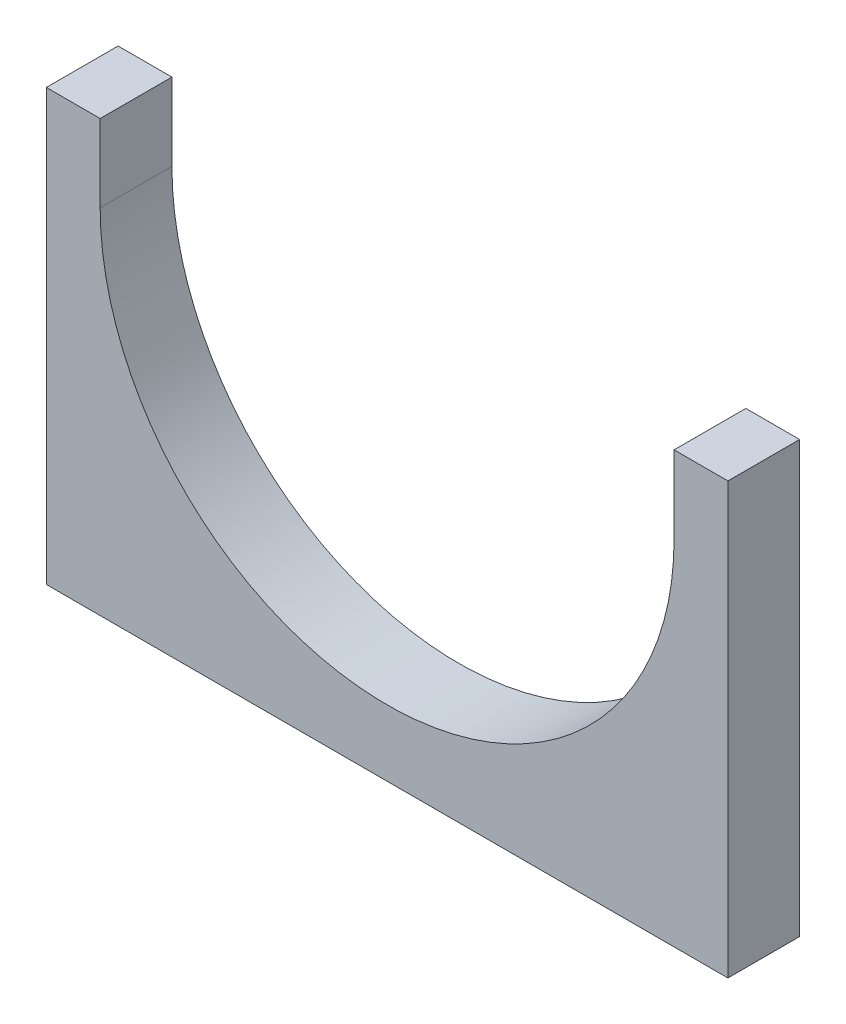
ISO-10303-21;
HEADER;
FILE_DESCRIPTION(('STEP AP214'),'2;1');
FILE_NAME('part.step','',(''),(''),'','','');
FILE_SCHEMA(('AUTOMOTIVE_DESIGN { 1 0 10303 214 1 1 1 1 }'));
ENDSEC;
DATA;
#1=APPLICATION_CONTEXT('core data for automotive mechanical design processes');
#2=APPLICATION_PROTOCOL_DEFINITION('international standard','automotive_design',2000,#1);
#3=PRODUCT_CONTEXT('',#1,'mechanical');
#4=PRODUCT('Part','Part','',(#3));
#5=PRODUCT_RELATED_PRODUCT_CATEGORY('part','',(#4));
#6=PRODUCT_DEFINITION_FORMATION('','',#4);
#7=PRODUCT_DEFINITION_CONTEXT('part definition',#1,'design');
#8=PRODUCT_DEFINITION('design','',#6,#7);
#9=PRODUCT_DEFINITION_SHAPE('','',#8);
#10=(LENGTH_UNIT() NAMED_UNIT(*) SI_UNIT(.MILLI.,.METRE.));
#11=(NAMED_UNIT(*) PLANE_ANGLE_UNIT() SI_UNIT($,.RADIAN.));
#12=(NAMED_UNIT(*) SI_UNIT($,.STERADIAN.) SOLID_ANGLE_UNIT());
#13=UNCERTAINTY_MEASURE_WITH_UNIT(LENGTH_MEASURE(1.E-05),#10,'distance_accuracy_value','');
#14=(GEOMETRIC_REPRESENTATION_CONTEXT(3) GLOBAL_UNCERTAINTY_ASSIGNED_CONTEXT((#13)) GLOBAL_UNIT_ASSIGNED_CONTEXT((#10,
#11,#12)) REPRESENTATION_CONTEXT('',''));
#15=CARTESIAN_POINT('',(0.,0.,0.));
#16=DIRECTION('',(0.,0.,1.));
#17=DIRECTION('',(1.,0.,0.));
#18=AXIS2_PLACEMENT_3D('',#15,#16,#17);
#19=CARTESIAN_POINT('',(0.,0.,101.6));
#20=DIRECTION('',(1.,0.,0.));
#21=DIRECTION('',(0.,0.,-1.));
#22=AXIS2_PLACEMENT_3D('',#19,#20,#21);
#23=PLANE('',#22);
#24=DIRECTION('',(0.,-1.,0.));
#25=VECTOR('',#24,1.);
#26=CARTESIAN_POINT('',(0.,0.,0.));
#27=LINE('',#26,#25);
#28=CARTESIAN_POINT('',(0.,609.6,0.));
#29=VERTEX_POINT('',#28);
#30=CARTESIAN_POINT('',(0.,0.,0.));
#31=VERTEX_POINT('',#30);
#32=EDGE_CURVE('E131',#29,#31,#27,.T.);
#33=ORIENTED_EDGE('',*,*,#32,.T.);
#34=DIRECTION('',(0.,0.,-1.));
#35=VECTOR('',#34,1.);
#36=CARTESIAN_POINT('',(0.,0.,101.6));
#37=LINE('',#36,#35);
#38=CARTESIAN_POINT('',(0.,0.,101.6));
#39=VERTEX_POINT('',#38);
#40=EDGE_CURVE('E11',#39,#31,#37,.T.);
#41=ORIENTED_EDGE('',*,*,#40,.F.);
#42=DIRECTION('',(0.,-1.,0.));
#43=VECTOR('',#42,1.);
#44=CARTESIAN_POINT('',(0.,0.,101.6));
#45=LINE('',#44,#43);
#46=CARTESIAN_POINT('',(0.,609.6,101.6));
#47=VERTEX_POINT('',#46);
#48=EDGE_CURVE('E145',#47,#39,#45,.T.);
#49=ORIENTED_EDGE('',*,*,#48,.F.);
#50=DIRECTION('',(0.,0.,-1.));
#51=VECTOR('',#50,1.);
#52=CARTESIAN_POINT('',(0.,609.6,101.6));
#53=LINE('',#52,#51);
#54=EDGE_CURVE('E127',#47,#29,#53,.T.);
#55=ORIENTED_EDGE('',*,*,#54,.T.);
#56=EDGE_LOOP('',(#33,#41,#49,#55));
#57=FACE_BOUND('',#56,.T.);
#58=ADVANCED_FACE('F35',(#57),#23,.F.);
#59=CARTESIAN_POINT('',(0.,0.,101.6));
#60=DIRECTION('',(0.,1.,0.));
#61=DIRECTION('',(0.,0.,1.));
#62=AXIS2_PLACEMENT_3D('',#59,#60,#61);
#63=PLANE('',#62);
#64=DIRECTION('',(1.,0.,0.));
#65=VECTOR('',#64,1.);
#66=CARTESIAN_POINT('',(0.,0.,0.));
#67=LINE('',#66,#65);
#68=CARTESIAN_POINT('',(965.1,0.,0.));
#69=VERTEX_POINT('',#68);
#70=EDGE_CURVE('E134',#31,#69,#67,.T.);
#71=ORIENTED_EDGE('',*,*,#70,.T.);
#72=DIRECTION('',(0.,0.,-1.));
#73=VECTOR('',#72,1.);
#74=CARTESIAN_POINT('',(965.1,0.,101.6));
#75=LINE('',#74,#73);
#76=CARTESIAN_POINT('',(965.1,0.,101.6));
#77=VERTEX_POINT('',#76);
#78=EDGE_CURVE('E43',#77,#69,#75,.T.);
#79=ORIENTED_EDGE('',*,*,#78,.F.);
#80=DIRECTION('',(1.,0.,0.));
#81=VECTOR('',#80,1.);
#82=CARTESIAN_POINT('',(0.,0.,101.6));
#83=LINE('',#82,#81);
#84=EDGE_CURVE('E94',#39,#77,#83,.T.);
#85=ORIENTED_EDGE('',*,*,#84,.F.);
#86=ORIENTED_EDGE('',*,*,#40,.T.);
#87=EDGE_LOOP('',(#71,#79,#85,#86));
#88=FACE_BOUND('',#87,.T.);
#89=ADVANCED_FACE('F180',(#88),#63,.F.);
#90=CARTESIAN_POINT('',(965.1,0.,101.6));
#91=DIRECTION('',(-1.,0.,0.));
#92=DIRECTION('',(0.,0.,1.));
#93=AXIS2_PLACEMENT_3D('',#90,#91,#92);
#94=PLANE('',#93);
#95=DIRECTION('',(0.,1.,0.));
#96=VECTOR('',#95,1.);
#97=CARTESIAN_POINT('',(965.1,0.,0.));
#98=LINE('',#97,#96);
#99=CARTESIAN_POINT('',(965.1,609.6,0.));
#100=VERTEX_POINT('',#99);
#101=EDGE_CURVE('E136',#69,#100,#98,.T.);
#102=ORIENTED_EDGE('',*,*,#101,.T.);
#103=DIRECTION('',(0.,0.,-1.));
#104=VECTOR('',#103,1.);
#105=CARTESIAN_POINT('',(965.1,609.6,101.6));
#106=LINE('',#105,#104);
#107=CARTESIAN_POINT('',(965.1,609.6,101.6));
#108=VERTEX_POINT('',#107);
#109=EDGE_CURVE('E152',#108,#100,#106,.T.);
#110=ORIENTED_EDGE('',*,*,#109,.F.);
#111=DIRECTION('',(0.,1.,0.));
#112=VECTOR('',#111,1.);
#113=CARTESIAN_POINT('',(965.1,0.,101.6));
#114=LINE('',#113,#112);
#115=EDGE_CURVE('E160',#77,#108,#114,.T.);
#116=ORIENTED_EDGE('',*,*,#115,.F.);
#117=ORIENTED_EDGE('',*,*,#78,.T.);
#118=EDGE_LOOP('',(#102,#110,#116,#117));
#119=FACE_BOUND('',#118,.T.);
#120=ADVANCED_FACE('F158',(#119),#94,.F.);
#121=CARTESIAN_POINT('',(888.9,609.6,101.6));
#122=DIRECTION('',(0.,-1.,0.));
#123=DIRECTION('',(0.,0.,-1.));
#124=AXIS2_PLACEMENT_3D('',#121,#122,#123);
#125=PLANE('',#124);
#126=DIRECTION('',(-1.,0.,0.));
#127=VECTOR('',#126,1.);
#128=CARTESIAN_POINT('',(888.9,609.6,0.));
#129=LINE('',#128,#127);
#130=CARTESIAN_POINT('',(888.9,609.6,0.));
#131=VERTEX_POINT('',#130);
#132=EDGE_CURVE('E138',#100,#131,#129,.T.);
#133=ORIENTED_EDGE('',*,*,#132,.T.);
#134=DIRECTION('',(0.,0.,-1.));
#135=VECTOR('',#134,1.);
#136=CARTESIAN_POINT('',(888.9,609.6,101.6));
#137=LINE('',#136,#135);
#138=CARTESIAN_POINT('',(888.9,609.6,101.6));
#139=VERTEX_POINT('',#138);
#140=EDGE_CURVE('E149',#139,#131,#137,.T.);
#141=ORIENTED_EDGE('',*,*,#140,.F.);
#142=DIRECTION('',(-1.,0.,0.));
#143=VECTOR('',#142,1.);
#144=CARTESIAN_POINT('',(888.9,609.6,101.6));
#145=LINE('',#144,#143);
#146=EDGE_CURVE('E172',#108,#139,#145,.T.);
#147=ORIENTED_EDGE('',*,*,#146,.F.);
#148=ORIENTED_EDGE('',*,*,#109,.T.);
#149=EDGE_LOOP('',(#133,#141,#147,#148));
#150=FACE_BOUND('',#149,.T.);
#151=ADVANCED_FACE('F168',(#150),#125,.F.);
#152=CARTESIAN_POINT('',(888.9,500.,101.6));
#153=DIRECTION('',(1.,0.,0.));
#154=DIRECTION('',(0.,1.,0.));
#155=AXIS2_PLACEMENT_3D('',#152,#153,#154);
#156=PLANE('',#155);
#157=DIRECTION('',(0.,-1.,0.));
#158=VECTOR('',#157,1.);
#159=CARTESIAN_POINT('',(888.9,500.,0.));
#160=LINE('',#159,#158);
#161=CARTESIAN_POINT('',(888.9,500.,0.));
#162=VERTEX_POINT('',#161);
#163=EDGE_CURVE('E140',#131,#162,#160,.T.);
#164=ORIENTED_EDGE('',*,*,#163,.T.);
#165=DIRECTION('',(0.,0.,-1.));
#166=VECTOR('',#165,1.);
#167=CARTESIAN_POINT('',(888.9,500.,101.6));
#168=LINE('',#167,#166);
#169=CARTESIAN_POINT('',(888.9,500.,101.6));
#170=VERTEX_POINT('',#169);
#171=EDGE_CURVE('E122',#170,#162,#168,.T.);
#172=ORIENTED_EDGE('',*,*,#171,.F.);
#173=DIRECTION('',(0.,-1.,0.));
#174=VECTOR('',#173,1.);
#175=CARTESIAN_POINT('',(888.9,500.,101.6));
#176=LINE('',#175,#174);
#177=EDGE_CURVE('E113',#139,#170,#176,.T.);
#178=ORIENTED_EDGE('',*,*,#177,.F.);
#179=ORIENTED_EDGE('',*,*,#140,.T.);
#180=EDGE_LOOP('',(#164,#172,#178,#179));
#181=FACE_BOUND('',#180,.T.);
#182=ADVANCED_FACE('F171',(#181),#156,.F.);
#183=CARTESIAN_POINT('',(482.55,500.,101.6));
#184=DIRECTION('',(0.,0.,-1.));
#185=DIRECTION('',(-1.,0.,0.));
#186=AXIS2_PLACEMENT_3D('',#183,#184,#185);
#187=CYLINDRICAL_SURFACE('',#186,406.35);
#188=CARTESIAN_POINT('',(482.55,500.,0.));
#189=DIRECTION('',(0.,0.,-1.));
#190=DIRECTION('',(1.,0.,0.));
#191=AXIS2_PLACEMENT_3D('',#188,#189,#190);
#192=CIRCLE('',#191,406.35);
#193=CARTESIAN_POINT('',(76.1999999999998,500.,0.));
#194=VERTEX_POINT('',#193);
#195=EDGE_CURVE('E121',#162,#194,#192,.T.);
#196=ORIENTED_EDGE('',*,*,#195,.T.);
#197=DIRECTION('',(0.,0.,-1.));
#198=VECTOR('',#197,1.);
#199=CARTESIAN_POINT('',(76.1999999999998,500.,101.6));
#200=LINE('',#199,#198);
#201=CARTESIAN_POINT('',(76.1999999999998,500.,101.6));
#202=VERTEX_POINT('',#201);
#203=EDGE_CURVE('E118',#202,#194,#200,.T.);
#204=ORIENTED_EDGE('',*,*,#203,.F.);
#205=CARTESIAN_POINT('',(482.55,500.,101.6));
#206=DIRECTION('',(0.,0.,-1.));
#207=DIRECTION('',(1.,0.,0.));
#208=AXIS2_PLACEMENT_3D('',#205,#206,#207);
#209=CIRCLE('',#208,406.35);
#210=EDGE_CURVE('E107',#170,#202,#209,.T.);
#211=ORIENTED_EDGE('',*,*,#210,.F.);
#212=ORIENTED_EDGE('',*,*,#171,.T.);
#213=EDGE_LOOP('',(#196,#204,#211,#212));
#214=FACE_BOUND('',#213,.T.);
#215=ADVANCED_FACE('F119',(#214),#187,.F.);
#216=CARTESIAN_POINT('',(76.1999999999998,500.,101.6));
#217=DIRECTION('',(-1.,0.,0.));
#218=DIRECTION('',(0.,-1.,0.));
#219=AXIS2_PLACEMENT_3D('',#216,#217,#218);
#220=PLANE('',#219);
#221=DIRECTION('',(0.,1.,0.));
#222=VECTOR('',#221,1.);
#223=CARTESIAN_POINT('',(76.1999999999998,500.,0.));
#224=LINE('',#223,#222);
#225=CARTESIAN_POINT('',(76.1999999999997,609.6,0.));
#226=VERTEX_POINT('',#225);
#227=EDGE_CURVE('E80',#194,#226,#224,.T.);
#228=ORIENTED_EDGE('',*,*,#227,.T.);
#229=DIRECTION('',(0.,0.,-1.));
#230=VECTOR('',#229,1.);
#231=CARTESIAN_POINT('',(76.1999999999997,609.6,101.6));
#232=LINE('',#231,#230);
#233=CARTESIAN_POINT('',(76.1999999999997,609.6,101.6));
#234=VERTEX_POINT('',#233);
#235=EDGE_CURVE('E123',#234,#226,#232,.T.);
#236=ORIENTED_EDGE('',*,*,#235,.F.);
#237=DIRECTION('',(0.,1.,0.));
#238=VECTOR('',#237,1.);
#239=CARTESIAN_POINT('',(76.1999999999998,500.,101.6));
#240=LINE('',#239,#238);
#241=EDGE_CURVE('E111',#202,#234,#240,.T.);
#242=ORIENTED_EDGE('',*,*,#241,.F.);
#243=ORIENTED_EDGE('',*,*,#203,.T.);
#244=EDGE_LOOP('',(#228,#236,#242,#243));
#245=FACE_BOUND('',#244,.T.);
#246=ADVANCED_FACE('F125',(#245),#220,.F.);
#247=CARTESIAN_POINT('',(0.,609.6,101.6));
#248=DIRECTION('',(0.,-1.,0.));
#249=DIRECTION('',(0.,0.,-1.));
#250=AXIS2_PLACEMENT_3D('',#247,#248,#249);
#251=PLANE('',#250);
#252=DIRECTION('',(-1.,0.,0.));
#253=VECTOR('',#252,1.);
#254=CARTESIAN_POINT('',(0.,609.6,0.));
#255=LINE('',#254,#253);
#256=EDGE_CURVE('E86',#226,#29,#255,.T.);
#257=ORIENTED_EDGE('',*,*,#256,.T.);
#258=ORIENTED_EDGE('',*,*,#54,.F.);
#259=DIRECTION('',(-1.,0.,0.));
#260=VECTOR('',#259,1.);
#261=CARTESIAN_POINT('',(0.,609.6,101.6));
#262=LINE('',#261,#260);
#263=EDGE_CURVE('E51',#234,#47,#262,.T.);
#264=ORIENTED_EDGE('',*,*,#263,.F.);
#265=ORIENTED_EDGE('',*,*,#235,.T.);
#266=EDGE_LOOP('',(#257,#258,#264,#265));
#267=FACE_BOUND('',#266,.T.);
#268=ADVANCED_FACE('F196',(#267),#251,.F.);
#269=CARTESIAN_POINT('',(482.55,500.,101.6));
#270=DIRECTION('',(0.,0.,1.));
#271=DIRECTION('',(1.,0.,0.));
#272=AXIS2_PLACEMENT_3D('',#269,#270,#271);
#273=PLANE('',#272);
#274=ORIENTED_EDGE('',*,*,#48,.T.);
#275=ORIENTED_EDGE('',*,*,#84,.T.);
#276=ORIENTED_EDGE('',*,*,#115,.T.);
#277=ORIENTED_EDGE('',*,*,#146,.T.);
#278=ORIENTED_EDGE('',*,*,#177,.T.);
#279=ORIENTED_EDGE('',*,*,#210,.T.);
#280=ORIENTED_EDGE('',*,*,#241,.T.);
#281=ORIENTED_EDGE('',*,*,#263,.T.);
#282=EDGE_LOOP('',(#274,#275,#276,#277,#278,#279,#280,#281));
#283=FACE_BOUND('',#282,.T.);
#284=ADVANCED_FACE('F109',(#283),#273,.T.);
#285=CARTESIAN_POINT('',(482.55,500.,0.));
#286=DIRECTION('',(0.,0.,1.));
#287=DIRECTION('',(1.,0.,0.));
#288=AXIS2_PLACEMENT_3D('',#285,#286,#287);
#289=PLANE('',#288);
#290=ORIENTED_EDGE('',*,*,#32,.F.);
#291=ORIENTED_EDGE('',*,*,#256,.F.);
#292=ORIENTED_EDGE('',*,*,#227,.F.);
#293=ORIENTED_EDGE('',*,*,#195,.F.);
#294=ORIENTED_EDGE('',*,*,#163,.F.);
#295=ORIENTED_EDGE('',*,*,#132,.F.);
#296=ORIENTED_EDGE('',*,*,#101,.F.);
#297=ORIENTED_EDGE('',*,*,#70,.F.);
#298=EDGE_LOOP('',(#290,#291,#292,#293,#294,#295,#296,#297));
#299=FACE_BOUND('',#298,.T.);
#300=ADVANCED_FACE('F164',(#299),#289,.F.);
#301=CLOSED_SHELL('',(#58,#89,#120,#151,#182,#215,#246,#268,#284,#300));
#302=MANIFOLD_SOLID_BREP('B2',#301);
#303=ADVANCED_BREP_SHAPE_REPRESENTATION('',(#18,#302),#14);
#304=SHAPE_DEFINITION_REPRESENTATION(#9,#303);
ENDSEC;
END-ISO-10303-21;
